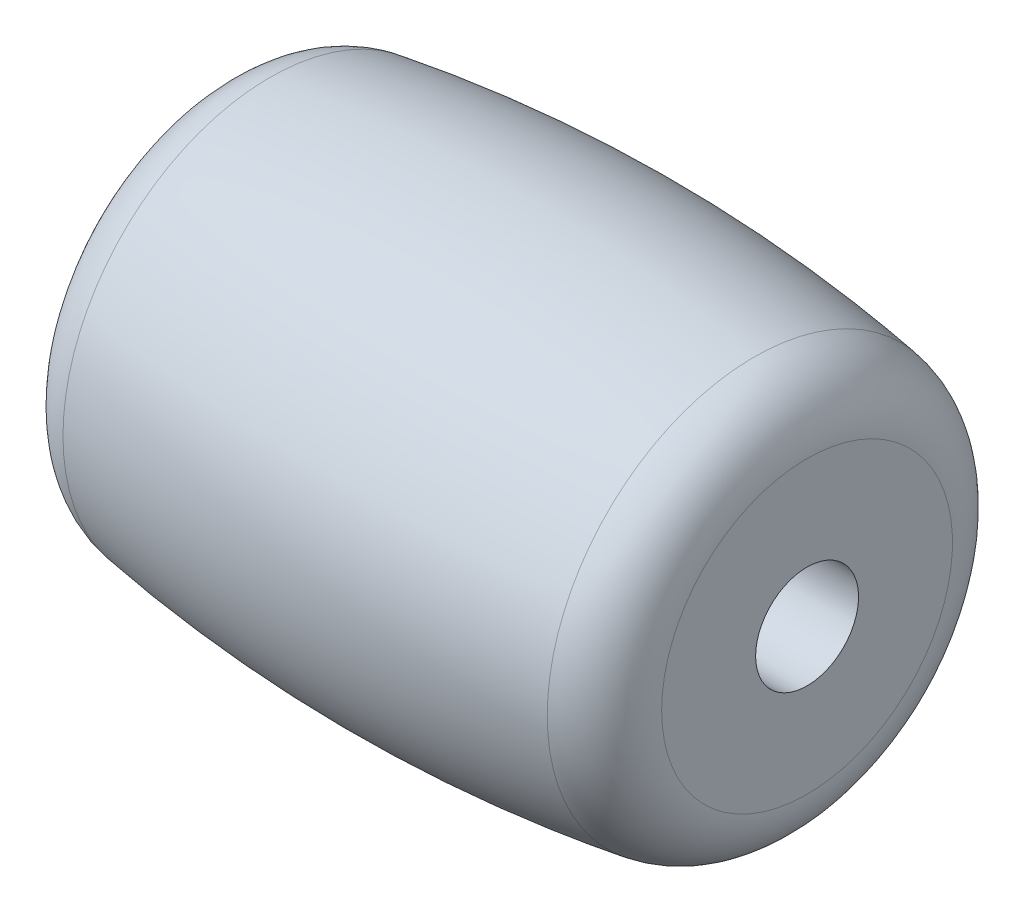
ISO-10303-21;
HEADER;
FILE_DESCRIPTION(('STEP AP214'),'2;1');
FILE_NAME('part.step','',(''),(''),'','','');
FILE_SCHEMA(('AUTOMOTIVE_DESIGN { 1 0 10303 214 1 1 1 1 }'));
ENDSEC;
DATA;
#1=APPLICATION_CONTEXT('core data for automotive mechanical design processes');
#2=APPLICATION_PROTOCOL_DEFINITION('international standard','automotive_design',2000,#1);
#3=PRODUCT_CONTEXT('',#1,'mechanical');
#4=PRODUCT('Part','Part','',(#3));
#5=PRODUCT_RELATED_PRODUCT_CATEGORY('part','',(#4));
#6=PRODUCT_DEFINITION_FORMATION('','',#4);
#7=PRODUCT_DEFINITION_CONTEXT('part definition',#1,'design');
#8=PRODUCT_DEFINITION('design','',#6,#7);
#9=PRODUCT_DEFINITION_SHAPE('','',#8);
#10=(LENGTH_UNIT() NAMED_UNIT(*) SI_UNIT(.MILLI.,.METRE.));
#11=(NAMED_UNIT(*) PLANE_ANGLE_UNIT() SI_UNIT($,.RADIAN.));
#12=(NAMED_UNIT(*) SI_UNIT($,.STERADIAN.) SOLID_ANGLE_UNIT());
#13=UNCERTAINTY_MEASURE_WITH_UNIT(LENGTH_MEASURE(1.E-05),#10,'distance_accuracy_value','');
#14=(GEOMETRIC_REPRESENTATION_CONTEXT(3) GLOBAL_UNCERTAINTY_ASSIGNED_CONTEXT((#13)) GLOBAL_UNIT_ASSIGNED_CONTEXT((#10,
#11,#12)) REPRESENTATION_CONTEXT('',''));
#15=CARTESIAN_POINT('',(0.,0.,0.));
#16=DIRECTION('',(0.,0.,1.));
#17=DIRECTION('',(1.,0.,0.));
#18=AXIS2_PLACEMENT_3D('',#15,#16,#17);
#19=CARTESIAN_POINT('',(7.4615,0.,0.));
#20=DIRECTION('',(-1.,0.,0.));
#21=DIRECTION('',(0.,0.,1.));
#22=AXIS2_PLACEMENT_3D('',#19,#20,#21);
#23=TOROIDAL_SURFACE('',#22,4.66519638484875,2.);
#24=CARTESIAN_POINT('',(7.76729918032787,0.,0.));
#25=DIRECTION('',(-1.,0.,0.));
#26=DIRECTION('',(0.,0.,1.));
#27=AXIS2_PLACEMENT_3D('',#24,#25,#26);
#28=CIRCLE('',#27,6.64167984324419);
#29=CARTESIAN_POINT('',(7.76729918032787,0.,6.64167984324419));
#30=VERTEX_POINT('',#29);
#31=EDGE_CURVE('E10',#30,#30,#28,.T.);
#32=ORIENTED_EDGE('',*,*,#31,.F.);
#33=EDGE_LOOP('',(#32));
#34=FACE_BOUND('',#33,.T.);
#35=CARTESIAN_POINT('',(9.4615,0.,0.));
#36=DIRECTION('',(-1.,0.,0.));
#37=DIRECTION('',(0.,0.,1.));
#38=AXIS2_PLACEMENT_3D('',#35,#36,#37);
#39=CIRCLE('',#38,4.66519638484875);
#40=CARTESIAN_POINT('',(9.4615,0.,4.66519638484875));
#41=VERTEX_POINT('',#40);
#42=EDGE_CURVE('E53',#41,#41,#39,.T.);
#43=ORIENTED_EDGE('',*,*,#42,.T.);
#44=EDGE_LOOP('',(#43));
#45=FACE_BOUND('',#44,.T.);
#46=ADVANCED_FACE('F31',(#34,#45),#23,.T.);
#47=CARTESIAN_POINT('',(0.,0.,0.));
#48=DIRECTION('',(-1.,0.,0.));
#49=DIRECTION('',(0.,0.,1.));
#50=AXIS2_PLACEMENT_3D('',#47,#48,#49);
#51=DEGENERATE_TOROIDAL_SURFACE('',#50,43.561,50.8,.F.);
#52=CARTESIAN_POINT('',(-7.76729918032787,0.,0.));
#53=DIRECTION('',(-1.,0.,0.));
#54=DIRECTION('',(0.,0.,1.));
#55=AXIS2_PLACEMENT_3D('',#52,#53,#54);
#56=CIRCLE('',#55,6.64167984324419);
#57=CARTESIAN_POINT('',(-7.76729918032787,0.,6.64167984324419));
#58=VERTEX_POINT('',#57);
#59=EDGE_CURVE('E37',#58,#58,#56,.T.);
#60=ORIENTED_EDGE('',*,*,#59,.F.);
#61=EDGE_LOOP('',(#60));
#62=FACE_BOUND('',#61,.T.);
#63=ORIENTED_EDGE('',*,*,#31,.T.);
#64=EDGE_LOOP('',(#63));
#65=FACE_BOUND('',#64,.T.);
#66=ADVANCED_FACE('F78',(#62,#65),#51,.F.);
#67=CARTESIAN_POINT('',(-7.4615,0.,0.));
#68=DIRECTION('',(-1.,0.,0.));
#69=DIRECTION('',(0.,0.,1.));
#70=AXIS2_PLACEMENT_3D('',#67,#68,#69);
#71=TOROIDAL_SURFACE('',#70,4.66519638484875,2.);
#72=CARTESIAN_POINT('',(-9.4615,0.,0.));
#73=DIRECTION('',(-1.,0.,0.));
#74=DIRECTION('',(0.,0.,1.));
#75=AXIS2_PLACEMENT_3D('',#72,#73,#74);
#76=CIRCLE('',#75,4.66519638484875);
#77=CARTESIAN_POINT('',(-9.4615,0.,4.66519638484875));
#78=VERTEX_POINT('',#77);
#79=EDGE_CURVE('E41',#78,#78,#76,.T.);
#80=ORIENTED_EDGE('',*,*,#79,.F.);
#81=EDGE_LOOP('',(#80));
#82=FACE_BOUND('',#81,.T.);
#83=ORIENTED_EDGE('',*,*,#59,.T.);
#84=EDGE_LOOP('',(#83));
#85=FACE_BOUND('',#84,.T.);
#86=ADVANCED_FACE('F73',(#82,#85),#71,.T.);
#87=CARTESIAN_POINT('',(-9.4615,1.651,0.));
#88=DIRECTION('',(1.,0.,0.));
#89=DIRECTION('',(0.,0.,-1.));
#90=AXIS2_PLACEMENT_3D('',#87,#88,#89);
#91=PLANE('',#90);
#92=CARTESIAN_POINT('',(-9.4615,0.,0.));
#93=DIRECTION('',(-1.,0.,0.));
#94=DIRECTION('',(0.,0.,1.));
#95=AXIS2_PLACEMENT_3D('',#92,#93,#94);
#96=CIRCLE('',#95,1.651);
#97=CARTESIAN_POINT('',(-9.4615,0.,1.651));
#98=VERTEX_POINT('',#97);
#99=EDGE_CURVE('E45',#98,#98,#96,.T.);
#100=ORIENTED_EDGE('',*,*,#99,.F.);
#101=EDGE_LOOP('',(#100));
#102=FACE_BOUND('',#101,.T.);
#103=ORIENTED_EDGE('',*,*,#79,.T.);
#104=EDGE_LOOP('',(#103));
#105=FACE_BOUND('',#104,.T.);
#106=ADVANCED_FACE('F67',(#102,#105),#91,.F.);
#107=CARTESIAN_POINT('',(0.,0.,0.));
#108=DIRECTION('',(-1.,0.,0.));
#109=DIRECTION('',(0.,0.,1.));
#110=AXIS2_PLACEMENT_3D('',#107,#108,#109);
#111=CYLINDRICAL_SURFACE('',#110,1.651);
#112=CARTESIAN_POINT('',(9.4615,0.,0.));
#113=DIRECTION('',(-1.,0.,0.));
#114=DIRECTION('',(0.,0.,1.));
#115=AXIS2_PLACEMENT_3D('',#112,#113,#114);
#116=CIRCLE('',#115,1.651);
#117=CARTESIAN_POINT('',(9.4615,0.,1.651));
#118=VERTEX_POINT('',#117);
#119=EDGE_CURVE('E50',#118,#118,#116,.T.);
#120=ORIENTED_EDGE('',*,*,#119,.F.);
#121=EDGE_LOOP('',(#120));
#122=FACE_BOUND('',#121,.T.);
#123=ORIENTED_EDGE('',*,*,#99,.T.);
#124=EDGE_LOOP('',(#123));
#125=FACE_BOUND('',#124,.T.);
#126=ADVANCED_FACE('F61',(#122,#125),#111,.F.);
#127=CARTESIAN_POINT('',(9.4615,1.651,0.));
#128=DIRECTION('',(-1.,0.,0.));
#129=DIRECTION('',(0.,0.,1.));
#130=AXIS2_PLACEMENT_3D('',#127,#128,#129);
#131=PLANE('',#130);
#132=ORIENTED_EDGE('',*,*,#42,.F.);
#133=EDGE_LOOP('',(#132));
#134=FACE_BOUND('',#133,.T.);
#135=ORIENTED_EDGE('',*,*,#119,.T.);
#136=EDGE_LOOP('',(#135));
#137=FACE_BOUND('',#136,.T.);
#138=ADVANCED_FACE('F58',(#134,#137),#131,.F.);
#139=CLOSED_SHELL('',(#46,#66,#86,#106,#126,#138));
#140=MANIFOLD_SOLID_BREP('B2',#139);
#141=ADVANCED_BREP_SHAPE_REPRESENTATION('',(#18,#140),#14);
#142=SHAPE_DEFINITION_REPRESENTATION(#9,#141);
ENDSEC;
END-ISO-10303-21;
